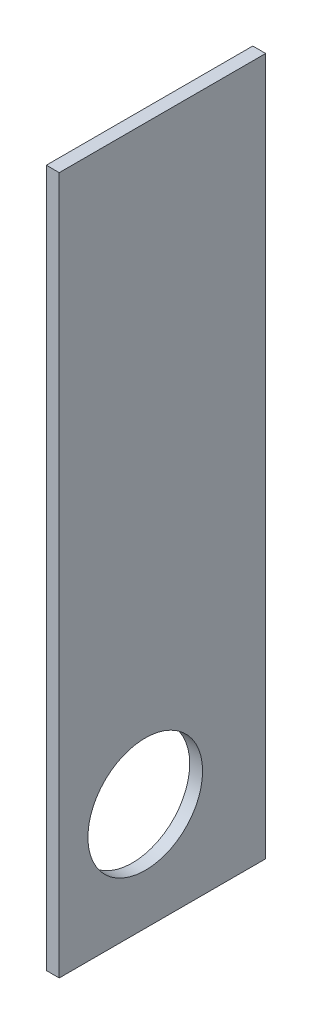
ISO-10303-21;
HEADER;
FILE_DESCRIPTION(('STEP AP214'),'2;1');
FILE_NAME('part.step','',(''),(''),'','','');
FILE_SCHEMA(('AUTOMOTIVE_DESIGN { 1 0 10303 214 1 1 1 1 }'));
ENDSEC;
DATA;
#1=APPLICATION_CONTEXT('core data for automotive mechanical design processes');
#2=APPLICATION_PROTOCOL_DEFINITION('international standard','automotive_design',2000,#1);
#3=PRODUCT_CONTEXT('',#1,'mechanical');
#4=PRODUCT('Part','Part','',(#3));
#5=PRODUCT_RELATED_PRODUCT_CATEGORY('part','',(#4));
#6=PRODUCT_DEFINITION_FORMATION('','',#4);
#7=PRODUCT_DEFINITION_CONTEXT('part definition',#1,'design');
#8=PRODUCT_DEFINITION('design','',#6,#7);
#9=PRODUCT_DEFINITION_SHAPE('','',#8);
#10=(LENGTH_UNIT() NAMED_UNIT(*) SI_UNIT(.MILLI.,.METRE.));
#11=(NAMED_UNIT(*) PLANE_ANGLE_UNIT() SI_UNIT($,.RADIAN.));
#12=(NAMED_UNIT(*) SI_UNIT($,.STERADIAN.) SOLID_ANGLE_UNIT());
#13=UNCERTAINTY_MEASURE_WITH_UNIT(LENGTH_MEASURE(1.E-05),#10,'distance_accuracy_value','');
#14=(GEOMETRIC_REPRESENTATION_CONTEXT(3) GLOBAL_UNCERTAINTY_ASSIGNED_CONTEXT((#13)) GLOBAL_UNIT_ASSIGNED_CONTEXT((#10,
#11,#12)) REPRESENTATION_CONTEXT('',''));
#15=CARTESIAN_POINT('',(0.,0.,0.));
#16=DIRECTION('',(0.,0.,1.));
#17=DIRECTION('',(1.,0.,0.));
#18=AXIS2_PLACEMENT_3D('',#15,#16,#17);
#19=CARTESIAN_POINT('',(18.,0.,0.));
#20=DIRECTION('',(1.,0.,0.));
#21=DIRECTION('',(0.,0.,-1.));
#22=AXIS2_PLACEMENT_3D('',#19,#20,#21);
#23=PLANE('',#22);
#24=DIRECTION('',(0.,-1.,0.));
#25=VECTOR('',#24,1.);
#26=CARTESIAN_POINT('',(18.,-676.121901091653,267.607933188847));
#27=LINE('',#26,#25);
#28=CARTESIAN_POINT('',(18.,57.7804435009756,267.607933188847));
#29=VERTEX_POINT('',#28);
#30=CARTESIAN_POINT('',(18.,-915.219556499024,267.607933188847));
#31=VERTEX_POINT('',#30);
#32=EDGE_CURVE('E79',#29,#31,#27,.T.);
#33=ORIENTED_EDGE('',*,*,#32,.T.);
#34=DIRECTION('',(0.,0.,-1.));
#35=VECTOR('',#34,1.);
#36=CARTESIAN_POINT('',(18.,-915.219556499024,-20.3920668111529));
#37=LINE('',#36,#35);
#38=CARTESIAN_POINT('',(18.,-915.219556499024,-20.3920668111529));
#39=VERTEX_POINT('',#38);
#40=EDGE_CURVE('E82',#31,#39,#37,.T.);
#41=ORIENTED_EDGE('',*,*,#40,.T.);
#42=DIRECTION('',(0.,1.,0.));
#43=VECTOR('',#42,1.);
#44=CARTESIAN_POINT('',(18.,-915.219556499024,-20.3920668111529));
#45=LINE('',#44,#43);
#46=CARTESIAN_POINT('',(18.,57.7804435009756,-20.3920668111529));
#47=VERTEX_POINT('',#46);
#48=EDGE_CURVE('E86',#39,#47,#45,.T.);
#49=ORIENTED_EDGE('',*,*,#48,.T.);
#50=DIRECTION('',(0.,0.,1.));
#51=VECTOR('',#50,1.);
#52=CARTESIAN_POINT('',(18.,57.7804435009756,-20.3920668111529));
#53=LINE('',#52,#51);
#54=EDGE_CURVE('E50',#47,#29,#53,.T.);
#55=ORIENTED_EDGE('',*,*,#54,.T.);
#56=EDGE_LOOP('',(#33,#41,#49,#55));
#57=FACE_BOUND('',#56,.T.);
#58=CARTESIAN_POINT('',(18.,-765.219556499024,147.607933188847));
#59=DIRECTION('',(1.,0.,0.));
#60=DIRECTION('',(0.,0.,-1.));
#61=AXIS2_PLACEMENT_3D('',#58,#59,#60);
#62=CIRCLE('',#61,80.);
#63=CARTESIAN_POINT('',(18.,-765.219556499024,67.6079331888471));
#64=VERTEX_POINT('',#63);
#65=EDGE_CURVE('E99',#64,#64,#62,.T.);
#66=ORIENTED_EDGE('',*,*,#65,.F.);
#67=EDGE_LOOP('',(#66));
#68=FACE_BOUND('',#67,.T.);
#69=ADVANCED_FACE('F33',(#57,#68),#23,.T.);
#70=CARTESIAN_POINT('',(0.,0.,0.));
#71=DIRECTION('',(1.,0.,0.));
#72=DIRECTION('',(0.,0.,-1.));
#73=AXIS2_PLACEMENT_3D('',#70,#71,#72);
#74=PLANE('',#73);
#75=DIRECTION('',(0.,-1.,0.));
#76=VECTOR('',#75,1.);
#77=CARTESIAN_POINT('',(0.,-915.219556499024,267.607933188847));
#78=LINE('',#77,#76);
#79=CARTESIAN_POINT('',(0.,57.7804435009756,267.607933188847));
#80=VERTEX_POINT('',#79);
#81=CARTESIAN_POINT('',(0.,-915.219556499024,267.607933188847));
#82=VERTEX_POINT('',#81);
#83=EDGE_CURVE('E74',#80,#82,#78,.T.);
#84=ORIENTED_EDGE('',*,*,#83,.F.);
#85=DIRECTION('',(0.,0.,1.));
#86=VECTOR('',#85,1.);
#87=CARTESIAN_POINT('',(0.,57.7804435009756,-20.3920668111529));
#88=LINE('',#87,#86);
#89=CARTESIAN_POINT('',(0.,57.7804435009756,-20.3920668111529));
#90=VERTEX_POINT('',#89);
#91=EDGE_CURVE('E102',#90,#80,#88,.T.);
#92=ORIENTED_EDGE('',*,*,#91,.F.);
#93=DIRECTION('',(0.,1.,0.));
#94=VECTOR('',#93,1.);
#95=CARTESIAN_POINT('',(0.,-915.219556499024,-20.3920668111529));
#96=LINE('',#95,#94);
#97=CARTESIAN_POINT('',(0.,-915.219556499024,-20.3920668111529));
#98=VERTEX_POINT('',#97);
#99=EDGE_CURVE('E67',#98,#90,#96,.T.);
#100=ORIENTED_EDGE('',*,*,#99,.F.);
#101=DIRECTION('',(0.,0.,-1.));
#102=VECTOR('',#101,1.);
#103=CARTESIAN_POINT('',(0.,-915.219556499024,-20.3920668111529));
#104=LINE('',#103,#102);
#105=EDGE_CURVE('E90',#82,#98,#104,.T.);
#106=ORIENTED_EDGE('',*,*,#105,.F.);
#107=EDGE_LOOP('',(#84,#92,#100,#106));
#108=FACE_BOUND('',#107,.T.);
#109=CARTESIAN_POINT('',(0.,-765.219556499024,147.607933188847));
#110=DIRECTION('',(1.,0.,0.));
#111=DIRECTION('',(0.,0.,-1.));
#112=AXIS2_PLACEMENT_3D('',#109,#110,#111);
#113=CIRCLE('',#112,80.);
#114=CARTESIAN_POINT('',(0.,-765.219556499024,67.6079331888471));
#115=VERTEX_POINT('',#114);
#116=EDGE_CURVE('E114',#115,#115,#113,.T.);
#117=ORIENTED_EDGE('',*,*,#116,.T.);
#118=EDGE_LOOP('',(#117));
#119=FACE_BOUND('',#118,.T.);
#120=ADVANCED_FACE('F108',(#108,#119),#74,.F.);
#121=CARTESIAN_POINT('',(18.,-915.219556499024,267.607933188847));
#122=DIRECTION('',(0.,0.,-1.));
#123=DIRECTION('',(-1.,0.,0.));
#124=AXIS2_PLACEMENT_3D('',#121,#122,#123);
#125=PLANE('',#124);
#126=ORIENTED_EDGE('',*,*,#83,.T.);
#127=DIRECTION('',(-1.,0.,0.));
#128=VECTOR('',#127,1.);
#129=CARTESIAN_POINT('',(18.,-915.219556499024,267.607933188847));
#130=LINE('',#129,#128);
#131=EDGE_CURVE('E11',#31,#82,#130,.T.);
#132=ORIENTED_EDGE('',*,*,#131,.F.);
#133=ORIENTED_EDGE('',*,*,#32,.F.);
#134=DIRECTION('',(-1.,0.,0.));
#135=VECTOR('',#134,1.);
#136=CARTESIAN_POINT('',(18.,57.7804435009756,267.607933188847));
#137=LINE('',#136,#135);
#138=EDGE_CURVE('E94',#29,#80,#137,.T.);
#139=ORIENTED_EDGE('',*,*,#138,.T.);
#140=EDGE_LOOP('',(#126,#132,#133,#139));
#141=FACE_BOUND('',#140,.T.);
#142=ADVANCED_FACE('F35',(#141),#125,.F.);
#143=CARTESIAN_POINT('',(18.,-915.219556499024,-20.3920668111529));
#144=DIRECTION('',(0.,1.,0.));
#145=DIRECTION('',(0.,0.,1.));
#146=AXIS2_PLACEMENT_3D('',#143,#144,#145);
#147=PLANE('',#146);
#148=ORIENTED_EDGE('',*,*,#105,.T.);
#149=DIRECTION('',(-1.,0.,0.));
#150=VECTOR('',#149,1.);
#151=CARTESIAN_POINT('',(18.,-915.219556499024,-20.3920668111529));
#152=LINE('',#151,#150);
#153=EDGE_CURVE('E42',#39,#98,#152,.T.);
#154=ORIENTED_EDGE('',*,*,#153,.F.);
#155=ORIENTED_EDGE('',*,*,#40,.F.);
#156=ORIENTED_EDGE('',*,*,#131,.T.);
#157=EDGE_LOOP('',(#148,#154,#155,#156));
#158=FACE_BOUND('',#157,.T.);
#159=ADVANCED_FACE('F89',(#158),#147,.F.);
#160=CARTESIAN_POINT('',(18.,-915.219556499024,-20.3920668111529));
#161=DIRECTION('',(0.,0.,1.));
#162=DIRECTION('',(1.,0.,0.));
#163=AXIS2_PLACEMENT_3D('',#160,#161,#162);
#164=PLANE('',#163);
#165=ORIENTED_EDGE('',*,*,#99,.T.);
#166=DIRECTION('',(-1.,0.,0.));
#167=VECTOR('',#166,1.);
#168=CARTESIAN_POINT('',(18.,57.7804435009756,-20.3920668111529));
#169=LINE('',#168,#167);
#170=EDGE_CURVE('E91',#47,#90,#169,.T.);
#171=ORIENTED_EDGE('',*,*,#170,.F.);
#172=ORIENTED_EDGE('',*,*,#48,.F.);
#173=ORIENTED_EDGE('',*,*,#153,.T.);
#174=EDGE_LOOP('',(#165,#171,#172,#173));
#175=FACE_BOUND('',#174,.T.);
#176=ADVANCED_FACE('F92',(#175),#164,.F.);
#177=CARTESIAN_POINT('',(18.,57.7804435009756,-20.3920668111529));
#178=DIRECTION('',(0.,-1.,0.));
#179=DIRECTION('',(0.,0.,-1.));
#180=AXIS2_PLACEMENT_3D('',#177,#178,#179);
#181=PLANE('',#180);
#182=ORIENTED_EDGE('',*,*,#91,.T.);
#183=ORIENTED_EDGE('',*,*,#138,.F.);
#184=ORIENTED_EDGE('',*,*,#54,.F.);
#185=ORIENTED_EDGE('',*,*,#170,.T.);
#186=EDGE_LOOP('',(#182,#183,#184,#185));
#187=FACE_BOUND('',#186,.T.);
#188=ADVANCED_FACE('F107',(#187),#181,.F.);
#189=CARTESIAN_POINT('',(18.,-765.219556499024,147.607933188847));
#190=DIRECTION('',(-1.,0.,0.));
#191=DIRECTION('',(0.,0.,1.));
#192=AXIS2_PLACEMENT_3D('',#189,#190,#191);
#193=CYLINDRICAL_SURFACE('',#192,80.);
#194=ORIENTED_EDGE('',*,*,#65,.T.);
#195=EDGE_LOOP('',(#194));
#196=FACE_BOUND('',#195,.T.);
#197=ORIENTED_EDGE('',*,*,#116,.F.);
#198=EDGE_LOOP('',(#197));
#199=FACE_BOUND('',#198,.T.);
#200=ADVANCED_FACE('F121',(#196,#199),#193,.F.);
#201=CLOSED_SHELL('',(#69,#120,#142,#159,#176,#188,#200));
#202=MANIFOLD_SOLID_BREP('B2',#201);
#203=ADVANCED_BREP_SHAPE_REPRESENTATION('',(#18,#202),#14);
#204=SHAPE_DEFINITION_REPRESENTATION(#9,#203);
ENDSEC;
END-ISO-10303-21;
